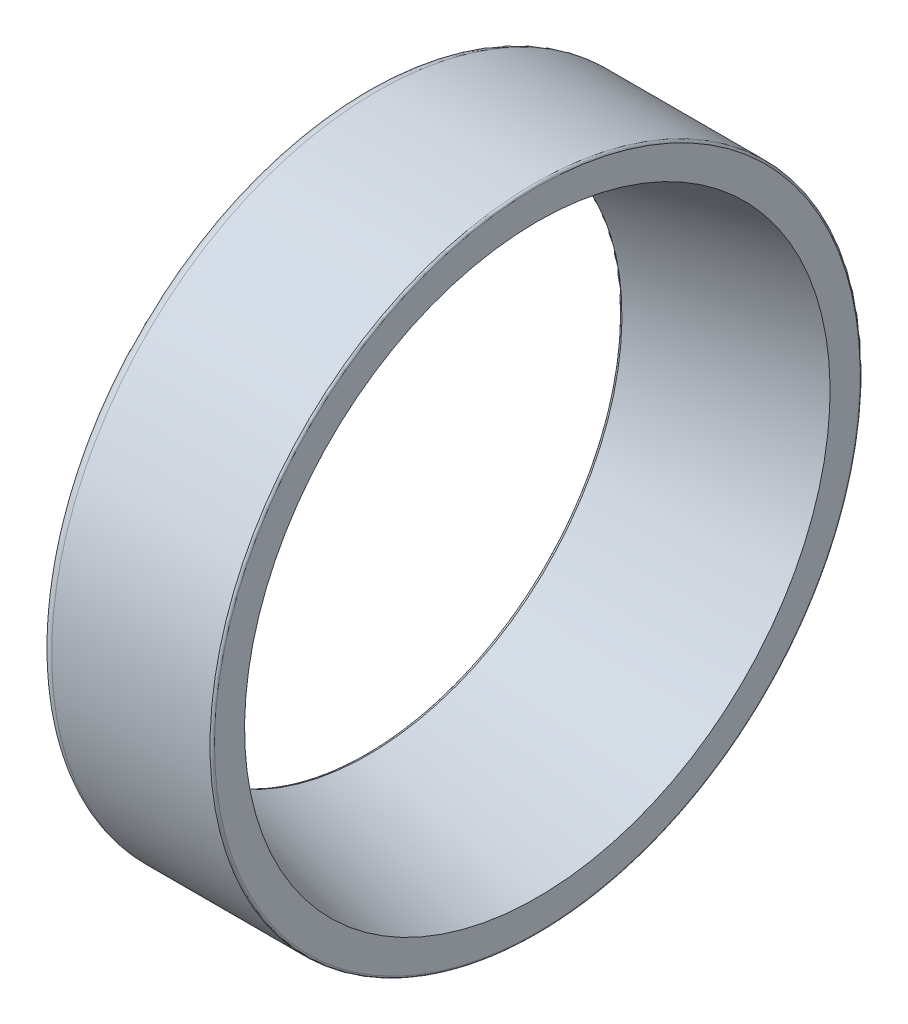
ISO-10303-21;
HEADER;
FILE_DESCRIPTION(('STEP AP214'),'2;1');
FILE_NAME('part.step','',(''),(''),'','','');
FILE_SCHEMA(('AUTOMOTIVE_DESIGN { 1 0 10303 214 1 1 1 1 }'));
ENDSEC;
DATA;
#1=APPLICATION_CONTEXT('core data for automotive mechanical design processes');
#2=APPLICATION_PROTOCOL_DEFINITION('international standard','automotive_design',2000,#1);
#3=PRODUCT_CONTEXT('',#1,'mechanical');
#4=PRODUCT('Part','Part','',(#3));
#5=PRODUCT_RELATED_PRODUCT_CATEGORY('part','',(#4));
#6=PRODUCT_DEFINITION_FORMATION('','',#4);
#7=PRODUCT_DEFINITION_CONTEXT('part definition',#1,'design');
#8=PRODUCT_DEFINITION('design','',#6,#7);
#9=PRODUCT_DEFINITION_SHAPE('','',#8);
#10=(LENGTH_UNIT() NAMED_UNIT(*) SI_UNIT(.MILLI.,.METRE.));
#11=(NAMED_UNIT(*) PLANE_ANGLE_UNIT() SI_UNIT($,.RADIAN.));
#12=(NAMED_UNIT(*) SI_UNIT($,.STERADIAN.) SOLID_ANGLE_UNIT());
#13=UNCERTAINTY_MEASURE_WITH_UNIT(LENGTH_MEASURE(1.E-05),#10,'distance_accuracy_value','');
#14=(GEOMETRIC_REPRESENTATION_CONTEXT(3) GLOBAL_UNCERTAINTY_ASSIGNED_CONTEXT((#13)) GLOBAL_UNIT_ASSIGNED_CONTEXT((#10,
#11,#12)) REPRESENTATION_CONTEXT('',''));
#15=CARTESIAN_POINT('',(0.,0.,0.));
#16=DIRECTION('',(0.,0.,1.));
#17=DIRECTION('',(1.,0.,0.));
#18=AXIS2_PLACEMENT_3D('',#15,#16,#17);
#19=CARTESIAN_POINT('',(0.12,0.,0.));
#20=DIRECTION('',(1.,0.,0.));
#21=DIRECTION('',(0.,0.,-1.));
#22=AXIS2_PLACEMENT_3D('',#19,#20,#21);
#23=TOROIDAL_SURFACE('',#22,13.7773912422423,0.12);
#24=CARTESIAN_POINT('',(0.146994126521264,0.,0.));
#25=DIRECTION('',(1.,0.,0.));
#26=DIRECTION('',(0.,1.,0.));
#27=AXIS2_PLACEMENT_3D('',#24,#25,#26);
#28=CIRCLE('',#27,13.660466834468);
#29=CARTESIAN_POINT('',(0.146994126521264,13.660466834468,0.));
#30=VERTEX_POINT('',#29);
#31=EDGE_CURVE('E11',#30,#30,#28,.T.);
#32=ORIENTED_EDGE('',*,*,#31,.T.);
#33=EDGE_LOOP('',(#32));
#34=FACE_BOUND('',#33,.T.);
#35=CARTESIAN_POINT('',(0.,0.,0.));
#36=DIRECTION('',(1.,0.,0.));
#37=DIRECTION('',(0.,1.,0.));
#38=AXIS2_PLACEMENT_3D('',#35,#36,#37);
#39=CIRCLE('',#38,13.7773912422423);
#40=CARTESIAN_POINT('',(0.,13.7773912422423,0.));
#41=VERTEX_POINT('',#40);
#42=EDGE_CURVE('E53',#41,#41,#39,.T.);
#43=ORIENTED_EDGE('',*,*,#42,.F.);
#44=EDGE_LOOP('',(#43));
#45=FACE_BOUND('',#44,.T.);
#46=ADVANCED_FACE('F16',(#34,#45),#23,.T.);
#47=CARTESIAN_POINT('',(4.69849706326063,0.,0.));
#48=DIRECTION('',(1.,0.,0.));
#49=DIRECTION('',(0.,1.,0.));
#50=AXIS2_PLACEMENT_3D('',#47,#48,#49);
#51=CONICAL_SURFACE('',#50,14.7112640843757,0.226892802759263);
#52=CARTESIAN_POINT('',(9.25,0.,0.));
#53=DIRECTION('',(1.,0.,0.));
#54=DIRECTION('',(0.,1.,0.));
#55=AXIS2_PLACEMENT_3D('',#52,#53,#54);
#56=CIRCLE('',#55,15.7620613342834);
#57=CARTESIAN_POINT('',(9.25,15.7620613342834,0.));
#58=VERTEX_POINT('',#57);
#59=EDGE_CURVE('E26',#58,#58,#56,.T.);
#60=ORIENTED_EDGE('',*,*,#59,.T.);
#61=EDGE_LOOP('',(#60));
#62=FACE_BOUND('',#61,.T.);
#63=ORIENTED_EDGE('',*,*,#31,.F.);
#64=EDGE_LOOP('',(#63));
#65=FACE_BOUND('',#64,.T.);
#66=ADVANCED_FACE('F65',(#62,#65),#51,.F.);
#67=CARTESIAN_POINT('',(9.25,16.5710306671417,0.));
#68=DIRECTION('',(1.,0.,0.));
#69=DIRECTION('',(0.,1.,0.));
#70=AXIS2_PLACEMENT_3D('',#67,#68,#69);
#71=PLANE('',#70);
#72=CARTESIAN_POINT('',(9.25,0.,0.));
#73=DIRECTION('',(1.,0.,0.));
#74=DIRECTION('',(0.,1.,0.));
#75=AXIS2_PLACEMENT_3D('',#72,#73,#74);
#76=CIRCLE('',#75,17.38);
#77=CARTESIAN_POINT('',(9.25,17.38,0.));
#78=VERTEX_POINT('',#77);
#79=EDGE_CURVE('E62',#78,#78,#76,.T.);
#80=ORIENTED_EDGE('',*,*,#79,.T.);
#81=EDGE_LOOP('',(#80));
#82=FACE_BOUND('',#81,.T.);
#83=ORIENTED_EDGE('',*,*,#59,.F.);
#84=EDGE_LOOP('',(#83));
#85=FACE_BOUND('',#84,.T.);
#86=ADVANCED_FACE('F68',(#82,#85),#71,.T.);
#87=CARTESIAN_POINT('',(9.13,0.,0.));
#88=DIRECTION('',(1.,0.,0.));
#89=DIRECTION('',(0.,0.,-1.));
#90=AXIS2_PLACEMENT_3D('',#87,#88,#89);
#91=TOROIDAL_SURFACE('',#90,17.38,0.12);
#92=CARTESIAN_POINT('',(9.13,0.,0.));
#93=DIRECTION('',(1.,0.,0.));
#94=DIRECTION('',(0.,1.,0.));
#95=AXIS2_PLACEMENT_3D('',#92,#93,#94);
#96=CIRCLE('',#95,17.5);
#97=CARTESIAN_POINT('',(9.13,17.5,0.));
#98=VERTEX_POINT('',#97);
#99=EDGE_CURVE('E46',#98,#98,#96,.T.);
#100=ORIENTED_EDGE('',*,*,#99,.T.);
#101=EDGE_LOOP('',(#100));
#102=FACE_BOUND('',#101,.T.);
#103=ORIENTED_EDGE('',*,*,#79,.F.);
#104=EDGE_LOOP('',(#103));
#105=FACE_BOUND('',#104,.T.);
#106=ADVANCED_FACE('F18',(#102,#105),#91,.T.);
#107=CARTESIAN_POINT('',(4.865,0.,0.));
#108=DIRECTION('',(-1.,0.,0.));
#109=DIRECTION('',(0.,1.,0.));
#110=AXIS2_PLACEMENT_3D('',#107,#108,#109);
#111=CYLINDRICAL_SURFACE('',#110,17.5);
#112=CARTESIAN_POINT('',(0.6,0.,0.));
#113=DIRECTION('',(1.,0.,0.));
#114=DIRECTION('',(0.,1.,0.));
#115=AXIS2_PLACEMENT_3D('',#112,#113,#114);
#116=CIRCLE('',#115,17.5);
#117=CARTESIAN_POINT('',(0.6,17.5,0.));
#118=VERTEX_POINT('',#117);
#119=EDGE_CURVE('E20',#118,#118,#116,.T.);
#120=ORIENTED_EDGE('',*,*,#119,.T.);
#121=EDGE_LOOP('',(#120));
#122=FACE_BOUND('',#121,.T.);
#123=ORIENTED_EDGE('',*,*,#99,.F.);
#124=EDGE_LOOP('',(#123));
#125=FACE_BOUND('',#124,.T.);
#126=ADVANCED_FACE('F77',(#122,#125),#111,.T.);
#127=CARTESIAN_POINT('',(0.6,0.,0.));
#128=DIRECTION('',(1.,0.,0.));
#129=DIRECTION('',(0.,0.,-1.));
#130=AXIS2_PLACEMENT_3D('',#127,#128,#129);
#131=TOROIDAL_SURFACE('',#130,16.9,0.6);
#132=CARTESIAN_POINT('',(0.,0.,0.));
#133=DIRECTION('',(1.,0.,0.));
#134=DIRECTION('',(0.,1.,0.));
#135=AXIS2_PLACEMENT_3D('',#132,#133,#134);
#136=CIRCLE('',#135,16.9);
#137=CARTESIAN_POINT('',(0.,16.9,0.));
#138=VERTEX_POINT('',#137);
#139=EDGE_CURVE('E57',#138,#138,#136,.T.);
#140=ORIENTED_EDGE('',*,*,#139,.T.);
#141=EDGE_LOOP('',(#140));
#142=FACE_BOUND('',#141,.T.);
#143=ORIENTED_EDGE('',*,*,#119,.F.);
#144=EDGE_LOOP('',(#143));
#145=FACE_BOUND('',#144,.T.);
#146=ADVANCED_FACE('F85',(#142,#145),#131,.T.);
#147=CARTESIAN_POINT('',(0.,15.3386956211212,0.));
#148=DIRECTION('',(-1.,0.,0.));
#149=DIRECTION('',(0.,-1.,0.));
#150=AXIS2_PLACEMENT_3D('',#147,#148,#149);
#151=PLANE('',#150);
#152=ORIENTED_EDGE('',*,*,#42,.T.);
#153=EDGE_LOOP('',(#152));
#154=FACE_BOUND('',#153,.T.);
#155=ORIENTED_EDGE('',*,*,#139,.F.);
#156=EDGE_LOOP('',(#155));
#157=FACE_BOUND('',#156,.T.);
#158=ADVANCED_FACE('F54',(#154,#157),#151,.T.);
#159=CLOSED_SHELL('',(#46,#66,#86,#106,#126,#146,#158));
#160=MANIFOLD_SOLID_BREP('B1',#159);
#161=ADVANCED_BREP_SHAPE_REPRESENTATION('',(#18,#160),#14);
#162=SHAPE_DEFINITION_REPRESENTATION(#9,#161);
ENDSEC;
END-ISO-10303-21;
